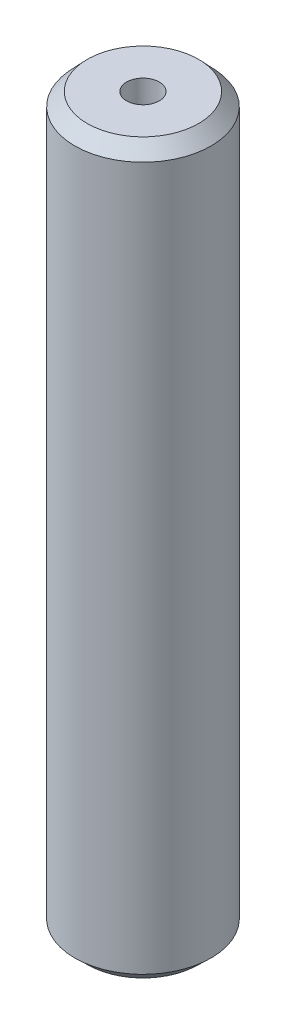
ISO-10303-21;
HEADER;
FILE_DESCRIPTION(('STEP AP214'),'2;1');
FILE_NAME('part.step','',(''),(''),'','','');
FILE_SCHEMA(('AUTOMOTIVE_DESIGN { 1 0 10303 214 1 1 1 1 }'));
ENDSEC;
DATA;
#1=APPLICATION_CONTEXT('core data for automotive mechanical design processes');
#2=APPLICATION_PROTOCOL_DEFINITION('international standard','automotive_design',2000,#1);
#3=PRODUCT_CONTEXT('',#1,'mechanical');
#4=PRODUCT('Part','Part','',(#3));
#5=PRODUCT_RELATED_PRODUCT_CATEGORY('part','',(#4));
#6=PRODUCT_DEFINITION_FORMATION('','',#4);
#7=PRODUCT_DEFINITION_CONTEXT('part definition',#1,'design');
#8=PRODUCT_DEFINITION('design','',#6,#7);
#9=PRODUCT_DEFINITION_SHAPE('','',#8);
#10=(LENGTH_UNIT() NAMED_UNIT(*) SI_UNIT(.MILLI.,.METRE.));
#11=(NAMED_UNIT(*) PLANE_ANGLE_UNIT() SI_UNIT($,.RADIAN.));
#12=(NAMED_UNIT(*) SI_UNIT($,.STERADIAN.) SOLID_ANGLE_UNIT());
#13=UNCERTAINTY_MEASURE_WITH_UNIT(LENGTH_MEASURE(1.E-05),#10,'distance_accuracy_value','');
#14=(GEOMETRIC_REPRESENTATION_CONTEXT(3) GLOBAL_UNCERTAINTY_ASSIGNED_CONTEXT((#13)) GLOBAL_UNIT_ASSIGNED_CONTEXT((#10,
#11,#12)) REPRESENTATION_CONTEXT('',''));
#15=CARTESIAN_POINT('',(0.,0.,0.));
#16=DIRECTION('',(0.,0.,1.));
#17=DIRECTION('',(1.,0.,0.));
#18=AXIS2_PLACEMENT_3D('',#15,#16,#17);
#19=CARTESIAN_POINT('',(0.,53.4900482078648,0.));
#20=DIRECTION('',(0.,-1.,0.));
#21=DIRECTION('',(0.,0.,-1.));
#22=AXIS2_PLACEMENT_3D('',#19,#20,#21);
#23=CYLINDRICAL_SURFACE('',#22,5.);
#24=CARTESIAN_POINT('',(0.,52.5245386504793,0.));
#25=DIRECTION('',(0.,1.,0.));
#26=DIRECTION('',(0.,0.,1.));
#27=AXIS2_PLACEMENT_3D('',#24,#25,#26);
#28=CIRCLE('',#27,5.);
#29=CARTESIAN_POINT('',(0.,52.5245386504793,5.));
#30=VERTEX_POINT('',#29);
#31=EDGE_CURVE('E50',#30,#30,#28,.F.);
#32=ORIENTED_EDGE('',*,*,#31,.T.);
#33=EDGE_LOOP('',(#32));
#34=FACE_BOUND('',#33,.T.);
#35=CARTESIAN_POINT('',(0.,0.916010629426596,0.));
#36=DIRECTION('',(0.,1.,0.));
#37=DIRECTION('',(0.,0.,1.));
#38=AXIS2_PLACEMENT_3D('',#35,#36,#37);
#39=CIRCLE('',#38,5.);
#40=CARTESIAN_POINT('',(0.,0.916010629426596,5.));
#41=VERTEX_POINT('',#40);
#42=EDGE_CURVE('E51',#41,#41,#39,.T.);
#43=ORIENTED_EDGE('',*,*,#42,.T.);
#44=EDGE_LOOP('',(#43));
#45=FACE_BOUND('',#44,.T.);
#46=ADVANCED_FACE('F39',(#34,#45),#23,.T.);
#47=CARTESIAN_POINT('',(0.,53.4900482078648,0.));
#48=DIRECTION('',(0.,1.,0.));
#49=DIRECTION('',(0.,0.,1.));
#50=AXIS2_PLACEMENT_3D('',#47,#48,#49);
#51=PLANE('',#50);
#52=CARTESIAN_POINT('',(0.,53.4900482078648,0.));
#53=DIRECTION('',(0.,1.,0.));
#54=DIRECTION('',(0.,0.,1.));
#55=AXIS2_PLACEMENT_3D('',#52,#53,#54);
#56=CIRCLE('',#55,4.08398937057342);
#57=CARTESIAN_POINT('',(0.,53.4900482078648,4.08398937057342));
#58=VERTEX_POINT('',#57);
#59=EDGE_CURVE('E54',#58,#58,#56,.T.);
#60=ORIENTED_EDGE('',*,*,#59,.T.);
#61=EDGE_LOOP('',(#60));
#62=FACE_BOUND('',#61,.T.);
#63=CARTESIAN_POINT('',(0.,53.4900482078648,0.));
#64=DIRECTION('',(0.,1.,0.));
#65=DIRECTION('',(0.,0.,1.));
#66=AXIS2_PLACEMENT_3D('',#63,#64,#65);
#67=CIRCLE('',#66,1.20018769813642);
#68=CARTESIAN_POINT('',(0.,53.4900482078648,1.20018769813642));
#69=VERTEX_POINT('',#68);
#70=EDGE_CURVE('E58',#69,#69,#67,.T.);
#71=ORIENTED_EDGE('',*,*,#70,.F.);
#72=EDGE_LOOP('',(#71));
#73=FACE_BOUND('',#72,.T.);
#74=ADVANCED_FACE('F69',(#62,#73),#51,.T.);
#75=CARTESIAN_POINT('',(0.,0.,0.));
#76=DIRECTION('',(0.,1.,0.));
#77=DIRECTION('',(0.,0.,1.));
#78=AXIS2_PLACEMENT_3D('',#75,#76,#77);
#79=PLANE('',#78);
#80=CARTESIAN_POINT('',(0.,0.,0.));
#81=DIRECTION('',(0.,1.,0.));
#82=DIRECTION('',(0.,0.,1.));
#83=AXIS2_PLACEMENT_3D('',#80,#81,#82);
#84=CIRCLE('',#83,4.03449044261441);
#85=CARTESIAN_POINT('',(0.,0.,4.03449044261441));
#86=VERTEX_POINT('',#85);
#87=EDGE_CURVE('E10',#86,#86,#84,.F.);
#88=ORIENTED_EDGE('',*,*,#87,.T.);
#89=EDGE_LOOP('',(#88));
#90=FACE_BOUND('',#89,.T.);
#91=CARTESIAN_POINT('',(0.,0.,0.));
#92=DIRECTION('',(0.,1.,0.));
#93=DIRECTION('',(0.,0.,1.));
#94=AXIS2_PLACEMENT_3D('',#91,#92,#93);
#95=CIRCLE('',#94,1.20018769813642);
#96=CARTESIAN_POINT('',(0.,0.,1.20018769813642));
#97=VERTEX_POINT('',#96);
#98=EDGE_CURVE('E63',#97,#97,#95,.T.);
#99=ORIENTED_EDGE('',*,*,#98,.T.);
#100=EDGE_LOOP('',(#99));
#101=FACE_BOUND('',#100,.T.);
#102=ADVANCED_FACE('F75',(#90,#101),#79,.F.);
#103=CARTESIAN_POINT('',(0.,53.4900482078648,0.));
#104=DIRECTION('',(0.,-1.,0.));
#105=DIRECTION('',(0.,0.,-1.));
#106=AXIS2_PLACEMENT_3D('',#103,#104,#105);
#107=CYLINDRICAL_SURFACE('',#106,1.20018769813642);
#108=ORIENTED_EDGE('',*,*,#70,.T.);
#109=EDGE_LOOP('',(#108));
#110=FACE_BOUND('',#109,.T.);
#111=ORIENTED_EDGE('',*,*,#98,.F.);
#112=EDGE_LOOP('',(#111));
#113=FACE_BOUND('',#112,.T.);
#114=ADVANCED_FACE('F70',(#110,#113),#107,.F.);
#115=CARTESIAN_POINT('',(0.,53.4900482078648,0.));
#116=DIRECTION('',(0.,-1.,0.));
#117=DIRECTION('',(0.,0.,-1.));
#118=AXIS2_PLACEMENT_3D('',#115,#116,#117);
#119=CONICAL_SURFACE('',#118,4.08398937057342,0.759096286057936);
#120=ORIENTED_EDGE('',*,*,#31,.F.);
#121=EDGE_LOOP('',(#120));
#122=FACE_BOUND('',#121,.T.);
#123=ORIENTED_EDGE('',*,*,#59,.F.);
#124=EDGE_LOOP('',(#123));
#125=FACE_BOUND('',#124,.T.);
#126=ADVANCED_FACE('F81',(#122,#125),#119,.T.);
#127=CARTESIAN_POINT('',(0.,0.916010629426596,0.));
#128=DIRECTION('',(0.,1.,0.));
#129=DIRECTION('',(0.,0.,1.));
#130=AXIS2_PLACEMENT_3D('',#127,#128,#129);
#131=CONICAL_SURFACE('',#130,5.,0.811700040736959);
#132=ORIENTED_EDGE('',*,*,#87,.F.);
#133=EDGE_LOOP('',(#132));
#134=FACE_BOUND('',#133,.T.);
#135=ORIENTED_EDGE('',*,*,#42,.F.);
#136=EDGE_LOOP('',(#135));
#137=FACE_BOUND('',#136,.T.);
#138=ADVANCED_FACE('F45',(#134,#137),#131,.T.);
#139=CLOSED_SHELL('',(#46,#74,#102,#114,#126,#138));
#140=MANIFOLD_SOLID_BREP('B2',#139);
#141=ADVANCED_BREP_SHAPE_REPRESENTATION('',(#18,#140),#14);
#142=SHAPE_DEFINITION_REPRESENTATION(#9,#141);
ENDSEC;
END-ISO-10303-21;
